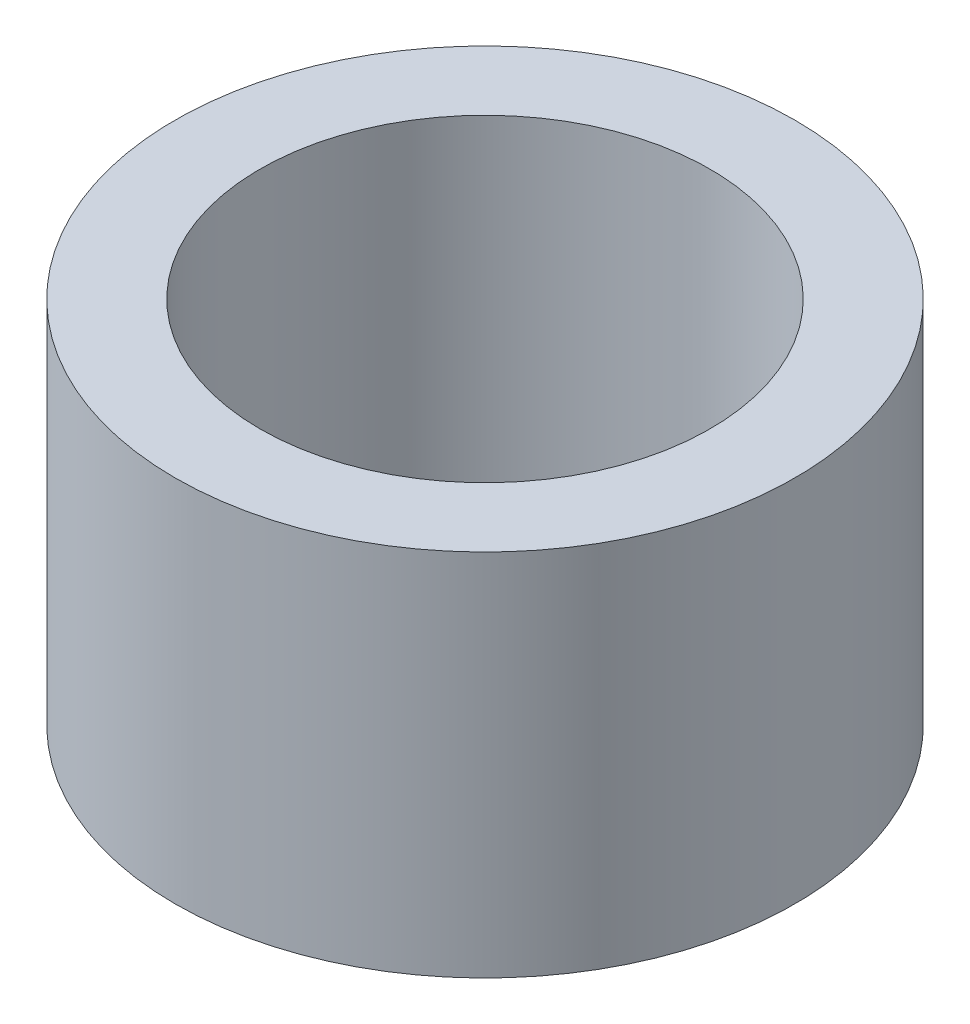
ISO-10303-21;
HEADER;
FILE_DESCRIPTION(('STEP AP214'),'2;1');
FILE_NAME('part.step','',(''),(''),'','','');
FILE_SCHEMA(('AUTOMOTIVE_DESIGN { 1 0 10303 214 1 1 1 1 }'));
ENDSEC;
DATA;
#1=APPLICATION_CONTEXT('core data for automotive mechanical design processes');
#2=APPLICATION_PROTOCOL_DEFINITION('international standard','automotive_design',2000,#1);
#3=PRODUCT_CONTEXT('',#1,'mechanical');
#4=PRODUCT('Part','Part','',(#3));
#5=PRODUCT_RELATED_PRODUCT_CATEGORY('part','',(#4));
#6=PRODUCT_DEFINITION_FORMATION('','',#4);
#7=PRODUCT_DEFINITION_CONTEXT('part definition',#1,'design');
#8=PRODUCT_DEFINITION('design','',#6,#7);
#9=PRODUCT_DEFINITION_SHAPE('','',#8);
#10=(LENGTH_UNIT() NAMED_UNIT(*) SI_UNIT(.MILLI.,.METRE.));
#11=(NAMED_UNIT(*) PLANE_ANGLE_UNIT() SI_UNIT($,.RADIAN.));
#12=(NAMED_UNIT(*) SI_UNIT($,.STERADIAN.) SOLID_ANGLE_UNIT());
#13=UNCERTAINTY_MEASURE_WITH_UNIT(LENGTH_MEASURE(1.E-05),#10,'distance_accuracy_value','');
#14=(GEOMETRIC_REPRESENTATION_CONTEXT(3) GLOBAL_UNCERTAINTY_ASSIGNED_CONTEXT((#13)) GLOBAL_UNIT_ASSIGNED_CONTEXT((#10,
#11,#12)) REPRESENTATION_CONTEXT('',''));
#15=CARTESIAN_POINT('',(0.,0.,0.));
#16=DIRECTION('',(0.,0.,1.));
#17=DIRECTION('',(1.,0.,0.));
#18=AXIS2_PLACEMENT_3D('',#15,#16,#17);
#19=CARTESIAN_POINT('',(0.,5.,0.));
#20=DIRECTION('',(0.,1.,0.));
#21=DIRECTION('',(0.,0.,1.));
#22=AXIS2_PLACEMENT_3D('',#19,#20,#21);
#23=PLANE('',#22);
#24=CARTESIAN_POINT('',(0.,5.,0.));
#25=DIRECTION('',(0.,1.,0.));
#26=DIRECTION('',(0.,0.,1.));
#27=AXIS2_PLACEMENT_3D('',#24,#25,#26);
#28=CIRCLE('',#27,8.4);
#29=CARTESIAN_POINT('',(0.,5.,8.4));
#30=VERTEX_POINT('',#29);
#31=EDGE_CURVE('E10',#30,#30,#28,.T.);
#32=ORIENTED_EDGE('',*,*,#31,.T.);
#33=EDGE_LOOP('',(#32));
#34=FACE_BOUND('',#33,.T.);
#35=CARTESIAN_POINT('',(0.,5.,0.));
#36=DIRECTION('',(0.,1.,0.));
#37=DIRECTION('',(0.,0.,1.));
#38=AXIS2_PLACEMENT_3D('',#35,#36,#37);
#39=CIRCLE('',#38,6.1);
#40=CARTESIAN_POINT('',(0.,5.,6.1));
#41=VERTEX_POINT('',#40);
#42=EDGE_CURVE('E56',#41,#41,#39,.T.);
#43=ORIENTED_EDGE('',*,*,#42,.F.);
#44=EDGE_LOOP('',(#43));
#45=FACE_BOUND('',#44,.T.);
#46=ADVANCED_FACE('F43',(#34,#45),#23,.T.);
#47=CARTESIAN_POINT('',(0.,-5.,0.));
#48=DIRECTION('',(0.,1.,0.));
#49=DIRECTION('',(0.,0.,1.));
#50=AXIS2_PLACEMENT_3D('',#47,#48,#49);
#51=PLANE('',#50);
#52=CARTESIAN_POINT('',(0.,-5.,0.));
#53=DIRECTION('',(0.,1.,0.));
#54=DIRECTION('',(0.,0.,1.));
#55=AXIS2_PLACEMENT_3D('',#52,#53,#54);
#56=CIRCLE('',#55,8.4);
#57=CARTESIAN_POINT('',(0.,-5.,8.4));
#58=VERTEX_POINT('',#57);
#59=EDGE_CURVE('E47',#58,#58,#56,.T.);
#60=ORIENTED_EDGE('',*,*,#59,.F.);
#61=EDGE_LOOP('',(#60));
#62=FACE_BOUND('',#61,.T.);
#63=CARTESIAN_POINT('',(0.,-5.,0.));
#64=DIRECTION('',(0.,1.,0.));
#65=DIRECTION('',(0.,0.,1.));
#66=AXIS2_PLACEMENT_3D('',#63,#64,#65);
#67=CIRCLE('',#66,6.1);
#68=CARTESIAN_POINT('',(0.,-5.,6.1));
#69=VERTEX_POINT('',#68);
#70=EDGE_CURVE('E58',#69,#69,#67,.T.);
#71=ORIENTED_EDGE('',*,*,#70,.T.);
#72=EDGE_LOOP('',(#71));
#73=FACE_BOUND('',#72,.T.);
#74=ADVANCED_FACE('F70',(#62,#73),#51,.F.);
#75=CARTESIAN_POINT('',(0.,5.,0.));
#76=DIRECTION('',(0.,-1.,0.));
#77=DIRECTION('',(0.,0.,-1.));
#78=AXIS2_PLACEMENT_3D('',#75,#76,#77);
#79=CYLINDRICAL_SURFACE('',#78,8.4);
#80=ORIENTED_EDGE('',*,*,#31,.F.);
#81=EDGE_LOOP('',(#80));
#82=FACE_BOUND('',#81,.T.);
#83=ORIENTED_EDGE('',*,*,#59,.T.);
#84=EDGE_LOOP('',(#83));
#85=FACE_BOUND('',#84,.T.);
#86=ADVANCED_FACE('F45',(#82,#85),#79,.T.);
#87=CARTESIAN_POINT('',(0.,5.,0.));
#88=DIRECTION('',(0.,-1.,0.));
#89=DIRECTION('',(0.,0.,-1.));
#90=AXIS2_PLACEMENT_3D('',#87,#88,#89);
#91=CYLINDRICAL_SURFACE('',#90,6.1);
#92=ORIENTED_EDGE('',*,*,#42,.T.);
#93=EDGE_LOOP('',(#92));
#94=FACE_BOUND('',#93,.T.);
#95=ORIENTED_EDGE('',*,*,#70,.F.);
#96=EDGE_LOOP('',(#95));
#97=FACE_BOUND('',#96,.T.);
#98=ADVANCED_FACE('F66',(#94,#97),#91,.F.);
#99=CLOSED_SHELL('',(#46,#74,#86,#98));
#100=MANIFOLD_SOLID_BREP('B2',#99);
#101=ADVANCED_BREP_SHAPE_REPRESENTATION('',(#18,#100),#14);
#102=SHAPE_DEFINITION_REPRESENTATION(#9,#101);
ENDSEC;
END-ISO-10303-21;
